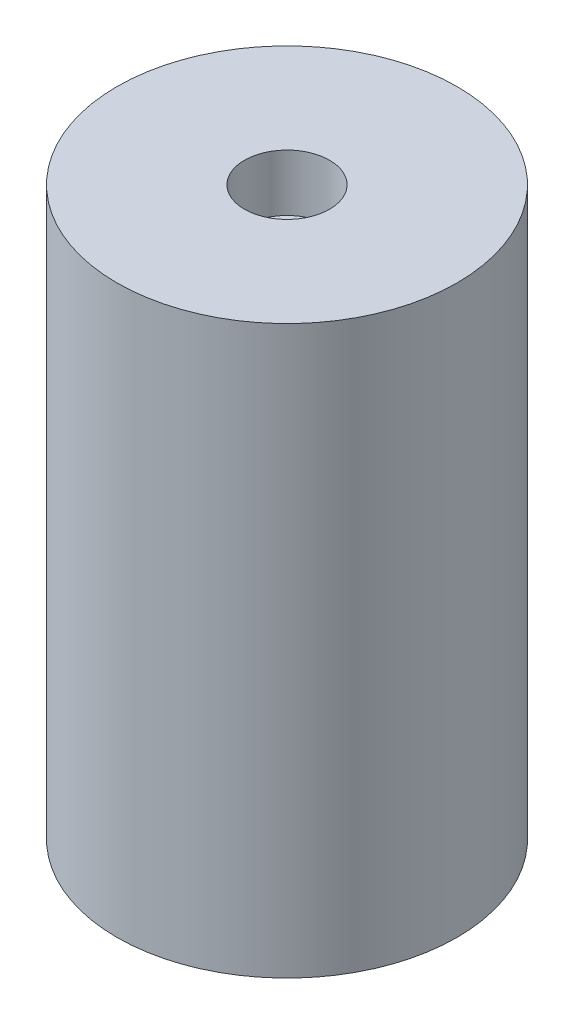
ISO-10303-21;
HEADER;
FILE_DESCRIPTION(('STEP AP214'),'2;1');
FILE_NAME('part.step','',(''),(''),'','','');
FILE_SCHEMA(('AUTOMOTIVE_DESIGN { 1 0 10303 214 1 1 1 1 }'));
ENDSEC;
DATA;
#1=APPLICATION_CONTEXT('core data for automotive mechanical design processes');
#2=APPLICATION_PROTOCOL_DEFINITION('international standard','automotive_design',2000,#1);
#3=PRODUCT_CONTEXT('',#1,'mechanical');
#4=PRODUCT('Part','Part','',(#3));
#5=PRODUCT_RELATED_PRODUCT_CATEGORY('part','',(#4));
#6=PRODUCT_DEFINITION_FORMATION('','',#4);
#7=PRODUCT_DEFINITION_CONTEXT('part definition',#1,'design');
#8=PRODUCT_DEFINITION('design','',#6,#7);
#9=PRODUCT_DEFINITION_SHAPE('','',#8);
#10=(LENGTH_UNIT() NAMED_UNIT(*) SI_UNIT(.MILLI.,.METRE.));
#11=(NAMED_UNIT(*) PLANE_ANGLE_UNIT() SI_UNIT($,.RADIAN.));
#12=(NAMED_UNIT(*) SI_UNIT($,.STERADIAN.) SOLID_ANGLE_UNIT());
#13=UNCERTAINTY_MEASURE_WITH_UNIT(LENGTH_MEASURE(1.E-05),#10,'distance_accuracy_value','');
#14=(GEOMETRIC_REPRESENTATION_CONTEXT(3) GLOBAL_UNCERTAINTY_ASSIGNED_CONTEXT((#13)) GLOBAL_UNIT_ASSIGNED_CONTEXT((#10,
#11,#12)) REPRESENTATION_CONTEXT('',''));
#15=CARTESIAN_POINT('',(0.,0.,0.));
#16=DIRECTION('',(0.,0.,1.));
#17=DIRECTION('',(1.,0.,0.));
#18=AXIS2_PLACEMENT_3D('',#15,#16,#17);
#19=CARTESIAN_POINT('',(0.,20.,0.));
#20=DIRECTION('',(0.,-1.,0.));
#21=DIRECTION('',(0.,0.,-1.));
#22=AXIS2_PLACEMENT_3D('',#19,#20,#21);
#23=CYLINDRICAL_SURFACE('',#22,6.);
#24=CARTESIAN_POINT('',(0.,20.,0.));
#25=DIRECTION('',(0.,1.,0.));
#26=DIRECTION('',(0.,0.,1.));
#27=AXIS2_PLACEMENT_3D('',#24,#25,#26);
#28=CIRCLE('',#27,6.);
#29=CARTESIAN_POINT('',(0.,20.,6.));
#30=VERTEX_POINT('',#29);
#31=EDGE_CURVE('E10',#30,#30,#28,.T.);
#32=ORIENTED_EDGE('',*,*,#31,.F.);
#33=EDGE_LOOP('',(#32));
#34=FACE_BOUND('',#33,.T.);
#35=CARTESIAN_POINT('',(0.,0.,0.));
#36=DIRECTION('',(0.,1.,0.));
#37=DIRECTION('',(0.,0.,1.));
#38=AXIS2_PLACEMENT_3D('',#35,#36,#37);
#39=CIRCLE('',#38,6.);
#40=CARTESIAN_POINT('',(0.,0.,6.));
#41=VERTEX_POINT('',#40);
#42=EDGE_CURVE('E36',#41,#41,#39,.T.);
#43=ORIENTED_EDGE('',*,*,#42,.T.);
#44=EDGE_LOOP('',(#43));
#45=FACE_BOUND('',#44,.T.);
#46=ADVANCED_FACE('F33',(#34,#45),#23,.T.);
#47=CARTESIAN_POINT('',(0.,20.,0.));
#48=DIRECTION('',(0.,1.,0.));
#49=DIRECTION('',(0.,0.,1.));
#50=AXIS2_PLACEMENT_3D('',#47,#48,#49);
#51=PLANE('',#50);
#52=CARTESIAN_POINT('',(0.,20.,0.));
#53=DIRECTION('',(0.,1.,0.));
#54=DIRECTION('',(0.,0.,1.));
#55=AXIS2_PLACEMENT_3D('',#52,#53,#54);
#56=CIRCLE('',#55,1.5);
#57=CARTESIAN_POINT('',(0.,20.,1.5));
#58=VERTEX_POINT('',#57);
#59=EDGE_CURVE('E45',#58,#58,#56,.T.);
#60=ORIENTED_EDGE('',*,*,#59,.F.);
#61=EDGE_LOOP('',(#60));
#62=FACE_BOUND('',#61,.T.);
#63=ORIENTED_EDGE('',*,*,#31,.T.);
#64=EDGE_LOOP('',(#63));
#65=FACE_BOUND('',#64,.T.);
#66=ADVANCED_FACE('F60',(#62,#65),#51,.T.);
#67=CARTESIAN_POINT('',(0.,0.,0.));
#68=DIRECTION('',(0.,1.,0.));
#69=DIRECTION('',(0.,0.,1.));
#70=AXIS2_PLACEMENT_3D('',#67,#68,#69);
#71=PLANE('',#70);
#72=ORIENTED_EDGE('',*,*,#42,.F.);
#73=EDGE_LOOP('',(#72));
#74=FACE_BOUND('',#73,.T.);
#75=ADVANCED_FACE('F56',(#74),#71,.F.);
#76=CARTESIAN_POINT('',(0.,18.,0.));
#77=DIRECTION('',(0.,1.,0.));
#78=DIRECTION('',(0.,0.,1.));
#79=AXIS2_PLACEMENT_3D('',#76,#77,#78);
#80=CYLINDRICAL_SURFACE('',#79,1.5);
#81=CARTESIAN_POINT('',(0.,18.,0.));
#82=DIRECTION('',(0.,1.,0.));
#83=DIRECTION('',(0.,0.,1.));
#84=AXIS2_PLACEMENT_3D('',#81,#82,#83);
#85=CIRCLE('',#84,1.5);
#86=CARTESIAN_POINT('',(0.,18.,1.5));
#87=VERTEX_POINT('',#86);
#88=EDGE_CURVE('E43',#87,#87,#85,.T.);
#89=ORIENTED_EDGE('',*,*,#88,.F.);
#90=EDGE_LOOP('',(#89));
#91=FACE_BOUND('',#90,.T.);
#92=ORIENTED_EDGE('',*,*,#59,.T.);
#93=EDGE_LOOP('',(#92));
#94=FACE_BOUND('',#93,.T.);
#95=ADVANCED_FACE('F53',(#91,#94),#80,.F.);
#96=CARTESIAN_POINT('',(0.,18.,0.));
#97=DIRECTION('',(0.,1.,0.));
#98=DIRECTION('',(0.,0.,1.));
#99=AXIS2_PLACEMENT_3D('',#96,#97,#98);
#100=PLANE('',#99);
#101=ORIENTED_EDGE('',*,*,#88,.T.);
#102=EDGE_LOOP('',(#101));
#103=FACE_BOUND('',#102,.T.);
#104=ADVANCED_FACE('F51',(#103),#100,.T.);
#105=CLOSED_SHELL('',(#46,#66,#75,#95,#104));
#106=MANIFOLD_SOLID_BREP('B2',#105);
#107=ADVANCED_BREP_SHAPE_REPRESENTATION('',(#18,#106),#14);
#108=SHAPE_DEFINITION_REPRESENTATION(#9,#107);
ENDSEC;
END-ISO-10303-21;
